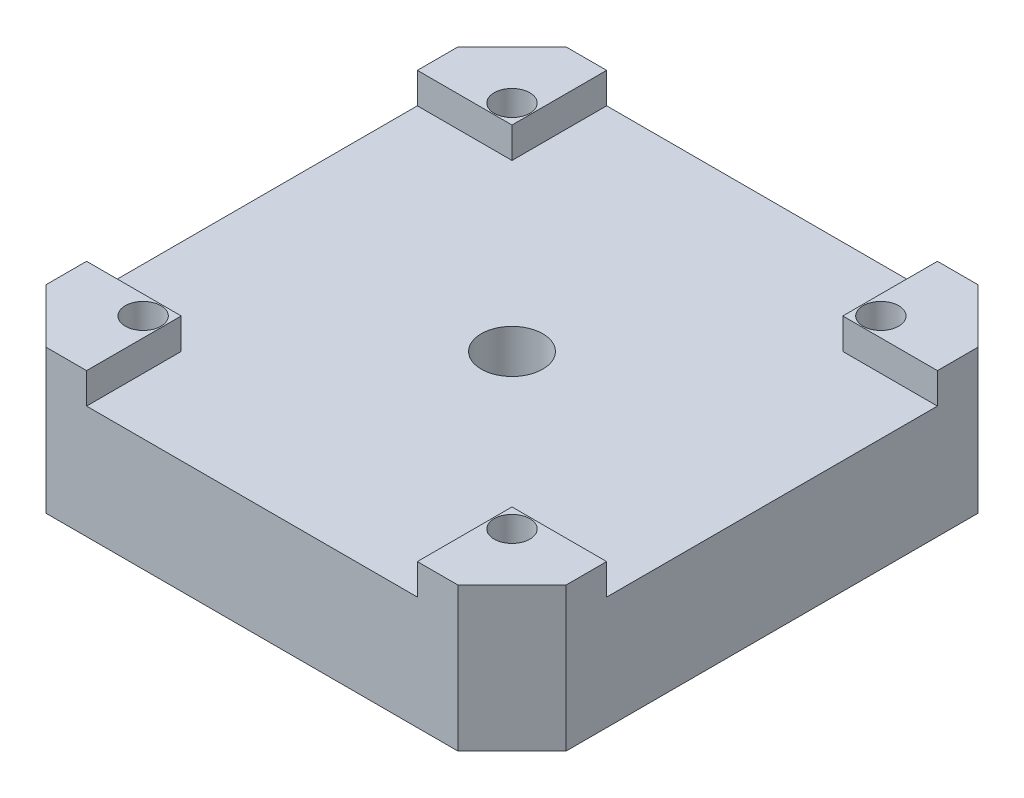
ISO-10303-21;
HEADER;
FILE_DESCRIPTION(('STEP AP214'),'2;1');
FILE_NAME('part.step','',(''),(''),'','','');
FILE_SCHEMA(('AUTOMOTIVE_DESIGN { 1 0 10303 214 1 1 1 1 }'));
ENDSEC;
DATA;
#1=APPLICATION_CONTEXT('core data for automotive mechanical design processes');
#2=APPLICATION_PROTOCOL_DEFINITION('international standard','automotive_design',2000,#1);
#3=PRODUCT_CONTEXT('',#1,'mechanical');
#4=PRODUCT('Part','Part','',(#3));
#5=PRODUCT_RELATED_PRODUCT_CATEGORY('part','',(#4));
#6=PRODUCT_DEFINITION_FORMATION('','',#4);
#7=PRODUCT_DEFINITION_CONTEXT('part definition',#1,'design');
#8=PRODUCT_DEFINITION('design','',#6,#7);
#9=PRODUCT_DEFINITION_SHAPE('','',#8);
#10=(LENGTH_UNIT() NAMED_UNIT(*) SI_UNIT(.MILLI.,.METRE.));
#11=(NAMED_UNIT(*) PLANE_ANGLE_UNIT() SI_UNIT($,.RADIAN.));
#12=(NAMED_UNIT(*) SI_UNIT($,.STERADIAN.) SOLID_ANGLE_UNIT());
#13=UNCERTAINTY_MEASURE_WITH_UNIT(LENGTH_MEASURE(1.E-05),#10,'distance_accuracy_value','');
#14=(GEOMETRIC_REPRESENTATION_CONTEXT(3) GLOBAL_UNCERTAINTY_ASSIGNED_CONTEXT((#13)) GLOBAL_UNIT_ASSIGNED_CONTEXT((#10,
#11,#12)) REPRESENTATION_CONTEXT('',''));
#15=CARTESIAN_POINT('',(0.,0.,0.));
#16=DIRECTION('',(0.,0.,1.));
#17=DIRECTION('',(1.,0.,0.));
#18=AXIS2_PLACEMENT_3D('',#15,#16,#17);
#19=CARTESIAN_POINT('',(0.,11.7,0.));
#20=DIRECTION('',(0.,-1.,0.));
#21=DIRECTION('',(0.,0.,-1.));
#22=AXIS2_PLACEMENT_3D('',#19,#20,#21);
#23=PLANE('',#22);
#24=CARTESIAN_POINT('',(15.,11.7,-15.));
#25=DIRECTION('',(0.,-1.,0.));
#26=DIRECTION('',(0.,0.,-1.));
#27=AXIS2_PLACEMENT_3D('',#24,#25,#26);
#28=CIRCLE('',#27,1.45);
#29=CARTESIAN_POINT('',(15.,11.7,-16.45));
#30=VERTEX_POINT('',#29);
#31=EDGE_CURVE('E364',#30,#30,#28,.T.);
#32=ORIENTED_EDGE('',*,*,#31,.T.);
#33=EDGE_LOOP('',(#32));
#34=FACE_BOUND('',#33,.T.);
#35=DIRECTION('',(-1.,0.,0.));
#36=VECTOR('',#35,1.);
#37=CARTESIAN_POINT('',(-16.750923471599,11.7,-21.15));
#38=LINE('',#37,#36);
#39=CARTESIAN_POINT('',(16.750923471599,11.7,-21.15));
#40=VERTEX_POINT('',#39);
#41=CARTESIAN_POINT('',(13.450923471599,11.7,-21.15));
#42=VERTEX_POINT('',#41);
#43=EDGE_CURVE('E193',#40,#42,#38,.T.);
#44=ORIENTED_EDGE('',*,*,#43,.T.);
#45=DIRECTION('',(0.,0.,1.));
#46=VECTOR('',#45,1.);
#47=CARTESIAN_POINT('',(13.450923471599,11.7,-21.15));
#48=LINE('',#47,#46);
#49=CARTESIAN_POINT('',(13.450923471599,11.7,-13.4509234715989));
#50=VERTEX_POINT('',#49);
#51=EDGE_CURVE('E301',#42,#50,#48,.T.);
#52=ORIENTED_EDGE('',*,*,#51,.T.);
#53=DIRECTION('',(1.,0.,0.));
#54=VECTOR('',#53,1.);
#55=CARTESIAN_POINT('',(-21.15,11.7,-13.4509234715989));
#56=LINE('',#55,#54);
#57=CARTESIAN_POINT('',(21.15,11.7,-13.4509234715989));
#58=VERTEX_POINT('',#57);
#59=EDGE_CURVE('E287',#50,#58,#56,.T.);
#60=ORIENTED_EDGE('',*,*,#59,.T.);
#61=DIRECTION('',(0.,0.,-1.));
#62=VECTOR('',#61,1.);
#63=CARTESIAN_POINT('',(21.15,11.7,16.7509234715989));
#64=LINE('',#63,#62);
#65=CARTESIAN_POINT('',(21.15,11.7,-16.7509234715989));
#66=VERTEX_POINT('',#65);
#67=EDGE_CURVE('E275',#58,#66,#64,.T.);
#68=ORIENTED_EDGE('',*,*,#67,.T.);
#69=DIRECTION('',(-0.707106781186542,0.,-0.707106781186553));
#70=VECTOR('',#69,1.);
#71=CARTESIAN_POINT('',(16.750923471599,11.7,-21.15));
#72=LINE('',#71,#70);
#73=EDGE_CURVE('E194',#66,#40,#72,.T.);
#74=ORIENTED_EDGE('',*,*,#73,.T.);
#75=EDGE_LOOP('',(#44,#52,#60,#68,#74));
#76=FACE_BOUND('',#75,.T.);
#77=ADVANCED_FACE('F34',(#34,#76),#23,.F.);
#78=CARTESIAN_POINT('',(15.,11.7,15.));
#79=DIRECTION('',(0.,-1.,0.));
#80=DIRECTION('',(0.,0.,-1.));
#81=AXIS2_PLACEMENT_3D('',#78,#79,#80);
#82=CIRCLE('',#81,1.45);
#83=CARTESIAN_POINT('',(15.,11.7,13.55));
#84=VERTEX_POINT('',#83);
#85=EDGE_CURVE('E376',#84,#84,#82,.T.);
#86=ORIENTED_EDGE('',*,*,#85,.T.);
#87=EDGE_LOOP('',(#86));
#88=FACE_BOUND('',#87,.T.);
#89=DIRECTION('',(1.,0.,0.));
#90=VECTOR('',#89,1.);
#91=CARTESIAN_POINT('',(-21.15,11.7,13.4509234715989));
#92=LINE('',#91,#90);
#93=CARTESIAN_POINT('',(13.450923471599,11.7,13.4509234715989));
#94=VERTEX_POINT('',#93);
#95=CARTESIAN_POINT('',(21.15,11.7,13.4509234715989));
#96=VERTEX_POINT('',#95);
#97=EDGE_CURVE('E265',#94,#96,#92,.T.);
#98=ORIENTED_EDGE('',*,*,#97,.F.);
#99=CARTESIAN_POINT('',(13.450923471599,11.7,21.15));
#100=VERTEX_POINT('',#99);
#101=EDGE_CURVE('E304',#94,#100,#48,.T.);
#102=ORIENTED_EDGE('',*,*,#101,.T.);
#103=DIRECTION('',(1.,0.,0.));
#104=VECTOR('',#103,1.);
#105=CARTESIAN_POINT('',(-16.750923471599,11.7,21.15));
#106=LINE('',#105,#104);
#107=CARTESIAN_POINT('',(16.750923471599,11.7,21.15));
#108=VERTEX_POINT('',#107);
#109=EDGE_CURVE('E270',#100,#108,#106,.T.);
#110=ORIENTED_EDGE('',*,*,#109,.T.);
#111=DIRECTION('',(0.707106781186546,0.,-0.707106781186549));
#112=VECTOR('',#111,1.);
#113=CARTESIAN_POINT('',(16.750923471599,11.7,21.15));
#114=LINE('',#113,#112);
#115=CARTESIAN_POINT('',(21.15,11.7,16.7509234715989));
#116=VERTEX_POINT('',#115);
#117=EDGE_CURVE('E274',#108,#116,#114,.T.);
#118=ORIENTED_EDGE('',*,*,#117,.T.);
#119=EDGE_CURVE('E198',#116,#96,#64,.T.);
#120=ORIENTED_EDGE('',*,*,#119,.T.);
#121=EDGE_LOOP('',(#98,#102,#110,#118,#120));
#122=FACE_BOUND('',#121,.T.);
#123=ADVANCED_FACE('F437',(#88,#122),#23,.F.);
#124=CARTESIAN_POINT('',(-21.15,9.2,-13.4509234715989));
#125=DIRECTION('',(0.,0.,-1.));
#126=DIRECTION('',(-1.,0.,0.));
#127=AXIS2_PLACEMENT_3D('',#124,#125,#126);
#128=PLANE('',#127);
#129=ORIENTED_EDGE('',*,*,#59,.F.);
#130=DIRECTION('',(0.,-1.,0.));
#131=VECTOR('',#130,1.);
#132=CARTESIAN_POINT('',(13.450923471599,9.20000000000002,-13.4509234715989));
#133=LINE('',#132,#131);
#134=CARTESIAN_POINT('',(13.450923471599,9.2,-13.4509234715989));
#135=VERTEX_POINT('',#134);
#136=EDGE_CURVE('E309',#50,#135,#133,.T.);
#137=ORIENTED_EDGE('',*,*,#136,.T.);
#138=DIRECTION('',(1.,0.,0.));
#139=VECTOR('',#138,1.);
#140=CARTESIAN_POINT('',(-21.15,9.2,-13.4509234715989));
#141=LINE('',#140,#139);
#142=CARTESIAN_POINT('',(21.15,9.2,-13.4509234715989));
#143=VERTEX_POINT('',#142);
#144=EDGE_CURVE('E257',#135,#143,#141,.T.);
#145=ORIENTED_EDGE('',*,*,#144,.T.);
#146=DIRECTION('',(0.,1.,0.));
#147=VECTOR('',#146,1.);
#148=CARTESIAN_POINT('',(21.15,9.2,-13.4509234715989));
#149=LINE('',#148,#147);
#150=EDGE_CURVE('E311',#143,#58,#149,.T.);
#151=ORIENTED_EDGE('',*,*,#150,.T.);
#152=EDGE_LOOP('',(#129,#137,#145,#151));
#153=FACE_BOUND('',#152,.T.);
#154=ADVANCED_FACE('F308',(#153),#128,.F.);
#155=CARTESIAN_POINT('',(-21.15,11.7,13.4509234715989));
#156=DIRECTION('',(0.,0.,1.));
#157=DIRECTION('',(1.,0.,0.));
#158=AXIS2_PLACEMENT_3D('',#155,#156,#157);
#159=PLANE('',#158);
#160=DIRECTION('',(1.,0.,0.));
#161=VECTOR('',#160,1.);
#162=CARTESIAN_POINT('',(-21.15,9.2,13.4509234715989));
#163=LINE('',#162,#161);
#164=CARTESIAN_POINT('',(13.450923471599,9.2,13.4509234715989));
#165=VERTEX_POINT('',#164);
#166=CARTESIAN_POINT('',(21.15,9.2,13.4509234715989));
#167=VERTEX_POINT('',#166);
#168=EDGE_CURVE('E258',#165,#167,#163,.T.);
#169=ORIENTED_EDGE('',*,*,#168,.F.);
#170=DIRECTION('',(0.,1.,0.));
#171=VECTOR('',#170,1.);
#172=CARTESIAN_POINT('',(13.450923471599,11.7,13.4509234715989));
#173=LINE('',#172,#171);
#174=EDGE_CURVE('E11',#165,#94,#173,.T.);
#175=ORIENTED_EDGE('',*,*,#174,.T.);
#176=ORIENTED_EDGE('',*,*,#97,.T.);
#177=DIRECTION('',(0.,-1.,0.));
#178=VECTOR('',#177,1.);
#179=CARTESIAN_POINT('',(21.15,11.7,13.4509234715989));
#180=LINE('',#179,#178);
#181=EDGE_CURVE('E319',#96,#167,#180,.T.);
#182=ORIENTED_EDGE('',*,*,#181,.T.);
#183=EDGE_LOOP('',(#169,#175,#176,#182));
#184=FACE_BOUND('',#183,.T.);
#185=ADVANCED_FACE('F447',(#184),#159,.F.);
#186=CARTESIAN_POINT('',(-15.,11.7,-15.));
#187=DIRECTION('',(0.,-1.,0.));
#188=DIRECTION('',(0.,0.,-1.));
#189=AXIS2_PLACEMENT_3D('',#186,#187,#188);
#190=CIRCLE('',#189,1.45);
#191=CARTESIAN_POINT('',(-15.,11.7,-16.45));
#192=VERTEX_POINT('',#191);
#193=EDGE_CURVE('E352',#192,#192,#190,.T.);
#194=ORIENTED_EDGE('',*,*,#193,.T.);
#195=EDGE_LOOP('',(#194));
#196=FACE_BOUND('',#195,.T.);
#197=CARTESIAN_POINT('',(-21.15,11.7,-13.4509234715989));
#198=VERTEX_POINT('',#197);
#199=CARTESIAN_POINT('',(-13.450923471599,11.7,-13.4509234715989));
#200=VERTEX_POINT('',#199);
#201=EDGE_CURVE('E186',#198,#200,#56,.T.);
#202=ORIENTED_EDGE('',*,*,#201,.T.);
#203=DIRECTION('',(0.,0.,1.));
#204=VECTOR('',#203,1.);
#205=CARTESIAN_POINT('',(-13.450923471599,11.7,-21.15));
#206=LINE('',#205,#204);
#207=CARTESIAN_POINT('',(-13.450923471599,11.7,-21.15));
#208=VERTEX_POINT('',#207);
#209=EDGE_CURVE('E49',#208,#200,#206,.T.);
#210=ORIENTED_EDGE('',*,*,#209,.F.);
#211=CARTESIAN_POINT('',(-16.750923471599,11.7,-21.15));
#212=VERTEX_POINT('',#211);
#213=EDGE_CURVE('E183',#208,#212,#38,.T.);
#214=ORIENTED_EDGE('',*,*,#213,.T.);
#215=DIRECTION('',(-0.707106781186546,0.,0.707106781186549));
#216=VECTOR('',#215,1.);
#217=CARTESIAN_POINT('',(-21.15,11.7,-16.7509234715989));
#218=LINE('',#217,#216);
#219=CARTESIAN_POINT('',(-21.15,11.7,-16.7509234715989));
#220=VERTEX_POINT('',#219);
#221=EDGE_CURVE('E197',#212,#220,#218,.T.);
#222=ORIENTED_EDGE('',*,*,#221,.T.);
#223=DIRECTION('',(0.,0.,1.));
#224=VECTOR('',#223,1.);
#225=CARTESIAN_POINT('',(-21.15,11.7,16.7509234715989));
#226=LINE('',#225,#224);
#227=EDGE_CURVE('E266',#220,#198,#226,.T.);
#228=ORIENTED_EDGE('',*,*,#227,.T.);
#229=EDGE_LOOP('',(#202,#210,#214,#222,#228));
#230=FACE_BOUND('',#229,.T.);
#231=ADVANCED_FACE('F182',(#196,#230),#23,.F.);
#232=CARTESIAN_POINT('',(-21.15,11.7,16.7509234715989));
#233=DIRECTION('',(1.,0.,0.));
#234=DIRECTION('',(0.,0.,-1.));
#235=AXIS2_PLACEMENT_3D('',#232,#233,#234);
#236=PLANE('',#235);
#237=DIRECTION('',(0.,0.,-1.));
#238=VECTOR('',#237,1.);
#239=CARTESIAN_POINT('',(-21.15,9.2,13.4509234715989));
#240=LINE('',#239,#238);
#241=CARTESIAN_POINT('',(-21.15,9.2,13.4509234715989));
#242=VERTEX_POINT('',#241);
#243=CARTESIAN_POINT('',(-21.15,9.2,-13.4509234715989));
#244=VERTEX_POINT('',#243);
#245=EDGE_CURVE('E255',#242,#244,#240,.T.);
#246=ORIENTED_EDGE('',*,*,#245,.T.);
#247=DIRECTION('',(0.,1.,0.));
#248=VECTOR('',#247,1.);
#249=CARTESIAN_POINT('',(-21.15,9.2,-13.4509234715989));
#250=LINE('',#249,#248);
#251=EDGE_CURVE('E322',#244,#198,#250,.T.);
#252=ORIENTED_EDGE('',*,*,#251,.T.);
#253=ORIENTED_EDGE('',*,*,#227,.F.);
#254=DIRECTION('',(0.,-1.,0.));
#255=VECTOR('',#254,1.);
#256=CARTESIAN_POINT('',(-21.15,11.7,-16.7509234715989));
#257=LINE('',#256,#255);
#258=CARTESIAN_POINT('',(-21.15,0.,-16.7509234715989));
#259=VERTEX_POINT('',#258);
#260=EDGE_CURVE('E203',#220,#259,#257,.T.);
#261=ORIENTED_EDGE('',*,*,#260,.T.);
#262=DIRECTION('',(0.,0.,1.));
#263=VECTOR('',#262,1.);
#264=CARTESIAN_POINT('',(-21.15,0.,16.7509234715989));
#265=LINE('',#264,#263);
#266=CARTESIAN_POINT('',(-21.15,0.,16.7509234715989));
#267=VERTEX_POINT('',#266);
#268=EDGE_CURVE('E204',#259,#267,#265,.T.);
#269=ORIENTED_EDGE('',*,*,#268,.T.);
#270=DIRECTION('',(0.,-1.,0.));
#271=VECTOR('',#270,1.);
#272=CARTESIAN_POINT('',(-21.15,11.7,16.7509234715989));
#273=LINE('',#272,#271);
#274=CARTESIAN_POINT('',(-21.15,11.7,16.7509234715989));
#275=VERTEX_POINT('',#274);
#276=EDGE_CURVE('E240',#275,#267,#273,.T.);
#277=ORIENTED_EDGE('',*,*,#276,.F.);
#278=CARTESIAN_POINT('',(-21.15,11.7,13.4509234715989));
#279=VERTEX_POINT('',#278);
#280=EDGE_CURVE('E221',#279,#275,#226,.T.);
#281=ORIENTED_EDGE('',*,*,#280,.F.);
#282=DIRECTION('',(0.,-1.,0.));
#283=VECTOR('',#282,1.);
#284=CARTESIAN_POINT('',(-21.15,11.7,13.4509234715989));
#285=LINE('',#284,#283);
#286=EDGE_CURVE('E315',#279,#242,#285,.T.);
#287=ORIENTED_EDGE('',*,*,#286,.T.);
#288=EDGE_LOOP('',(#246,#252,#253,#261,#269,#277,#281,#287));
#289=FACE_BOUND('',#288,.T.);
#290=ADVANCED_FACE('F36',(#289),#236,.F.);
#291=CARTESIAN_POINT('',(-21.15,11.7,16.7509234715989));
#292=DIRECTION('',(0.707106781186553,0.,-0.707106781186542));
#293=DIRECTION('',(-0.707106781186542,0.,-0.707106781186553));
#294=AXIS2_PLACEMENT_3D('',#291,#292,#293);
#295=PLANE('',#294);
#296=DIRECTION('',(0.707106781186542,0.,0.707106781186553));
#297=VECTOR('',#296,1.);
#298=CARTESIAN_POINT('',(-21.15,0.,16.7509234715989));
#299=LINE('',#298,#297);
#300=CARTESIAN_POINT('',(-16.750923471599,0.,21.15));
#301=VERTEX_POINT('',#300);
#302=EDGE_CURVE('E207',#267,#301,#299,.T.);
#303=ORIENTED_EDGE('',*,*,#302,.T.);
#304=DIRECTION('',(0.,-1.,0.));
#305=VECTOR('',#304,1.);
#306=CARTESIAN_POINT('',(-16.750923471599,11.7,21.15));
#307=LINE('',#306,#305);
#308=CARTESIAN_POINT('',(-16.750923471599,11.7,21.15));
#309=VERTEX_POINT('',#308);
#310=EDGE_CURVE('E237',#309,#301,#307,.T.);
#311=ORIENTED_EDGE('',*,*,#310,.F.);
#312=DIRECTION('',(0.707106781186542,0.,0.707106781186553));
#313=VECTOR('',#312,1.);
#314=CARTESIAN_POINT('',(-21.15,11.7,16.7509234715989));
#315=LINE('',#314,#313);
#316=EDGE_CURVE('E268',#275,#309,#315,.T.);
#317=ORIENTED_EDGE('',*,*,#316,.F.);
#318=ORIENTED_EDGE('',*,*,#276,.T.);
#319=EDGE_LOOP('',(#303,#311,#317,#318));
#320=FACE_BOUND('',#319,.T.);
#321=ADVANCED_FACE('F720',(#320),#295,.F.);
#322=CARTESIAN_POINT('',(-16.750923471599,11.7,21.15));
#323=DIRECTION('',(0.,0.,-1.));
#324=DIRECTION('',(-1.,0.,0.));
#325=AXIS2_PLACEMENT_3D('',#322,#323,#324);
#326=PLANE('',#325);
#327=ORIENTED_EDGE('',*,*,#109,.F.);
#328=DIRECTION('',(0.,1.,0.));
#329=VECTOR('',#328,1.);
#330=CARTESIAN_POINT('',(13.450923471599,9.2,21.15));
#331=LINE('',#330,#329);
#332=CARTESIAN_POINT('',(13.450923471599,9.2,21.15));
#333=VERTEX_POINT('',#332);
#334=EDGE_CURVE('E178',#333,#100,#331,.T.);
#335=ORIENTED_EDGE('',*,*,#334,.F.);
#336=DIRECTION('',(1.,0.,0.));
#337=VECTOR('',#336,1.);
#338=CARTESIAN_POINT('',(-13.450923471599,9.2,21.15));
#339=LINE('',#338,#337);
#340=CARTESIAN_POINT('',(-13.450923471599,9.2,21.15));
#341=VERTEX_POINT('',#340);
#342=EDGE_CURVE('E334',#341,#333,#339,.T.);
#343=ORIENTED_EDGE('',*,*,#342,.F.);
#344=DIRECTION('',(0.,-1.,0.));
#345=VECTOR('',#344,1.);
#346=CARTESIAN_POINT('',(-13.450923471599,11.7,21.15));
#347=LINE('',#346,#345);
#348=CARTESIAN_POINT('',(-13.450923471599,11.7,21.15));
#349=VERTEX_POINT('',#348);
#350=EDGE_CURVE('E336',#349,#341,#347,.T.);
#351=ORIENTED_EDGE('',*,*,#350,.F.);
#352=EDGE_CURVE('E271',#309,#349,#106,.T.);
#353=ORIENTED_EDGE('',*,*,#352,.F.);
#354=ORIENTED_EDGE('',*,*,#310,.T.);
#355=DIRECTION('',(1.,0.,0.));
#356=VECTOR('',#355,1.);
#357=CARTESIAN_POINT('',(-16.750923471599,0.,21.15));
#358=LINE('',#357,#356);
#359=CARTESIAN_POINT('',(16.750923471599,0.,21.15));
#360=VERTEX_POINT('',#359);
#361=EDGE_CURVE('E209',#301,#360,#358,.T.);
#362=ORIENTED_EDGE('',*,*,#361,.T.);
#363=DIRECTION('',(0.,-1.,0.));
#364=VECTOR('',#363,1.);
#365=CARTESIAN_POINT('',(16.750923471599,11.7,21.15));
#366=LINE('',#365,#364);
#367=EDGE_CURVE('E234',#108,#360,#366,.T.);
#368=ORIENTED_EDGE('',*,*,#367,.F.);
#369=EDGE_LOOP('',(#327,#335,#343,#351,#353,#354,#362,#368));
#370=FACE_BOUND('',#369,.T.);
#371=ADVANCED_FACE('F739',(#370),#326,.F.);
#372=CARTESIAN_POINT('',(16.750923471599,11.7,21.15));
#373=DIRECTION('',(-0.707106781186549,0.,-0.707106781186546));
#374=DIRECTION('',(-0.707106781186546,0.,0.707106781186549));
#375=AXIS2_PLACEMENT_3D('',#372,#373,#374);
#376=PLANE('',#375);
#377=DIRECTION('',(0.707106781186546,0.,-0.707106781186549));
#378=VECTOR('',#377,1.);
#379=CARTESIAN_POINT('',(16.750923471599,0.,21.15));
#380=LINE('',#379,#378);
#381=CARTESIAN_POINT('',(21.15,0.,16.7509234715989));
#382=VERTEX_POINT('',#381);
#383=EDGE_CURVE('E211',#360,#382,#380,.T.);
#384=ORIENTED_EDGE('',*,*,#383,.T.);
#385=DIRECTION('',(0.,-1.,0.));
#386=VECTOR('',#385,1.);
#387=CARTESIAN_POINT('',(21.15,11.7,16.7509234715989));
#388=LINE('',#387,#386);
#389=EDGE_CURVE('E231',#116,#382,#388,.T.);
#390=ORIENTED_EDGE('',*,*,#389,.F.);
#391=ORIENTED_EDGE('',*,*,#117,.F.);
#392=ORIENTED_EDGE('',*,*,#367,.T.);
#393=EDGE_LOOP('',(#384,#390,#391,#392));
#394=FACE_BOUND('',#393,.T.);
#395=ADVANCED_FACE('F709',(#394),#376,.F.);
#396=CARTESIAN_POINT('',(21.15,11.7,16.7509234715989));
#397=DIRECTION('',(-1.,0.,0.));
#398=DIRECTION('',(0.,0.,1.));
#399=AXIS2_PLACEMENT_3D('',#396,#397,#398);
#400=PLANE('',#399);
#401=ORIENTED_EDGE('',*,*,#67,.F.);
#402=ORIENTED_EDGE('',*,*,#150,.F.);
#403=DIRECTION('',(0.,0.,-1.));
#404=VECTOR('',#403,1.);
#405=CARTESIAN_POINT('',(21.15,9.2,13.4509234715989));
#406=LINE('',#405,#404);
#407=EDGE_CURVE('E316',#167,#143,#406,.T.);
#408=ORIENTED_EDGE('',*,*,#407,.F.);
#409=ORIENTED_EDGE('',*,*,#181,.F.);
#410=ORIENTED_EDGE('',*,*,#119,.F.);
#411=ORIENTED_EDGE('',*,*,#389,.T.);
#412=DIRECTION('',(0.,0.,-1.));
#413=VECTOR('',#412,1.);
#414=CARTESIAN_POINT('',(21.15,0.,16.7509234715989));
#415=LINE('',#414,#413);
#416=CARTESIAN_POINT('',(21.15,0.,-16.7509234715989));
#417=VERTEX_POINT('',#416);
#418=EDGE_CURVE('E213',#382,#417,#415,.T.);
#419=ORIENTED_EDGE('',*,*,#418,.T.);
#420=DIRECTION('',(0.,-1.,0.));
#421=VECTOR('',#420,1.);
#422=CARTESIAN_POINT('',(21.15,11.7,-16.7509234715989));
#423=LINE('',#422,#421);
#424=EDGE_CURVE('E228',#66,#417,#423,.T.);
#425=ORIENTED_EDGE('',*,*,#424,.F.);
#426=EDGE_LOOP('',(#401,#402,#408,#409,#410,#411,#419,#425));
#427=FACE_BOUND('',#426,.T.);
#428=ADVANCED_FACE('F291',(#427),#400,.F.);
#429=CARTESIAN_POINT('',(16.750923471599,11.7,-21.15));
#430=DIRECTION('',(-0.707106781186553,0.,0.707106781186542));
#431=DIRECTION('',(0.707106781186542,0.,0.707106781186553));
#432=AXIS2_PLACEMENT_3D('',#429,#430,#431);
#433=PLANE('',#432);
#434=DIRECTION('',(-0.707106781186542,0.,-0.707106781186553));
#435=VECTOR('',#434,1.);
#436=CARTESIAN_POINT('',(16.750923471599,0.,-21.15));
#437=LINE('',#436,#435);
#438=CARTESIAN_POINT('',(16.750923471599,0.,-21.15));
#439=VERTEX_POINT('',#438);
#440=EDGE_CURVE('E215',#417,#439,#437,.T.);
#441=ORIENTED_EDGE('',*,*,#440,.T.);
#442=DIRECTION('',(0.,-1.,0.));
#443=VECTOR('',#442,1.);
#444=CARTESIAN_POINT('',(16.750923471599,11.7,-21.15));
#445=LINE('',#444,#443);
#446=EDGE_CURVE('E225',#40,#439,#445,.T.);
#447=ORIENTED_EDGE('',*,*,#446,.F.);
#448=ORIENTED_EDGE('',*,*,#73,.F.);
#449=ORIENTED_EDGE('',*,*,#424,.T.);
#450=EDGE_LOOP('',(#441,#447,#448,#449));
#451=FACE_BOUND('',#450,.T.);
#452=ADVANCED_FACE('F295',(#451),#433,.F.);
#453=CARTESIAN_POINT('',(-16.750923471599,11.7,-21.15));
#454=DIRECTION('',(0.,0.,1.));
#455=DIRECTION('',(1.,0.,0.));
#456=AXIS2_PLACEMENT_3D('',#453,#454,#455);
#457=PLANE('',#456);
#458=DIRECTION('',(1.,0.,0.));
#459=VECTOR('',#458,1.);
#460=CARTESIAN_POINT('',(-13.450923471599,9.2,-21.15));
#461=LINE('',#460,#459);
#462=CARTESIAN_POINT('',(-13.450923471599,9.2,-21.15));
#463=VERTEX_POINT('',#462);
#464=CARTESIAN_POINT('',(13.450923471599,9.2,-21.15));
#465=VERTEX_POINT('',#464);
#466=EDGE_CURVE('E177',#463,#465,#461,.T.);
#467=ORIENTED_EDGE('',*,*,#466,.T.);
#468=DIRECTION('',(0.,1.,0.));
#469=VECTOR('',#468,1.);
#470=CARTESIAN_POINT('',(13.450923471599,9.2,-21.15));
#471=LINE('',#470,#469);
#472=EDGE_CURVE('E300',#465,#42,#471,.T.);
#473=ORIENTED_EDGE('',*,*,#472,.T.);
#474=ORIENTED_EDGE('',*,*,#43,.F.);
#475=ORIENTED_EDGE('',*,*,#446,.T.);
#476=DIRECTION('',(-1.,0.,0.));
#477=VECTOR('',#476,1.);
#478=CARTESIAN_POINT('',(-16.750923471599,0.,-21.15));
#479=LINE('',#478,#477);
#480=CARTESIAN_POINT('',(-16.750923471599,0.,-21.15));
#481=VERTEX_POINT('',#480);
#482=EDGE_CURVE('E217',#439,#481,#479,.T.);
#483=ORIENTED_EDGE('',*,*,#482,.T.);
#484=DIRECTION('',(0.,-1.,0.));
#485=VECTOR('',#484,1.);
#486=CARTESIAN_POINT('',(-16.750923471599,11.7,-21.15));
#487=LINE('',#486,#485);
#488=EDGE_CURVE('E191',#212,#481,#487,.T.);
#489=ORIENTED_EDGE('',*,*,#488,.F.);
#490=ORIENTED_EDGE('',*,*,#213,.F.);
#491=DIRECTION('',(0.,-1.,0.));
#492=VECTOR('',#491,1.);
#493=CARTESIAN_POINT('',(-13.450923471599,11.7,-21.15));
#494=LINE('',#493,#492);
#495=EDGE_CURVE('E169',#208,#463,#494,.T.);
#496=ORIENTED_EDGE('',*,*,#495,.T.);
#497=EDGE_LOOP('',(#467,#473,#474,#475,#483,#489,#490,#496));
#498=FACE_BOUND('',#497,.T.);
#499=ADVANCED_FACE('F189',(#498),#457,.F.);
#500=CARTESIAN_POINT('',(-21.15,11.7,-16.7509234715989));
#501=DIRECTION('',(0.707106781186549,0.,0.707106781186546));
#502=DIRECTION('',(0.707106781186546,0.,-0.707106781186549));
#503=AXIS2_PLACEMENT_3D('',#500,#501,#502);
#504=PLANE('',#503);
#505=DIRECTION('',(-0.707106781186546,0.,0.707106781186549));
#506=VECTOR('',#505,1.);
#507=CARTESIAN_POINT('',(-21.15,0.,-16.7509234715989));
#508=LINE('',#507,#506);
#509=EDGE_CURVE('E219',#481,#259,#508,.T.);
#510=ORIENTED_EDGE('',*,*,#509,.T.);
#511=ORIENTED_EDGE('',*,*,#260,.F.);
#512=ORIENTED_EDGE('',*,*,#221,.F.);
#513=ORIENTED_EDGE('',*,*,#488,.T.);
#514=EDGE_LOOP('',(#510,#511,#512,#513));
#515=FACE_BOUND('',#514,.T.);
#516=ADVANCED_FACE('F426',(#515),#504,.F.);
#517=CARTESIAN_POINT('',(-15.,11.7,15.));
#518=DIRECTION('',(0.,-1.,0.));
#519=DIRECTION('',(0.,0.,-1.));
#520=AXIS2_PLACEMENT_3D('',#517,#518,#519);
#521=CIRCLE('',#520,1.45);
#522=CARTESIAN_POINT('',(-15.,11.7,13.55));
#523=VERTEX_POINT('',#522);
#524=EDGE_CURVE('E388',#523,#523,#521,.T.);
#525=ORIENTED_EDGE('',*,*,#524,.T.);
#526=EDGE_LOOP('',(#525));
#527=FACE_BOUND('',#526,.T.);
#528=ORIENTED_EDGE('',*,*,#352,.T.);
#529=CARTESIAN_POINT('',(-13.450923471599,11.7,13.4509234715989));
#530=VERTEX_POINT('',#529);
#531=EDGE_CURVE('E187',#530,#349,#206,.T.);
#532=ORIENTED_EDGE('',*,*,#531,.F.);
#533=EDGE_CURVE('E249',#279,#530,#92,.T.);
#534=ORIENTED_EDGE('',*,*,#533,.F.);
#535=ORIENTED_EDGE('',*,*,#280,.T.);
#536=ORIENTED_EDGE('',*,*,#316,.T.);
#537=EDGE_LOOP('',(#528,#532,#534,#535,#536));
#538=FACE_BOUND('',#537,.T.);
#539=ADVANCED_FACE('F407',(#527,#538),#23,.F.);
#540=CARTESIAN_POINT('',(0.,0.,0.));
#541=DIRECTION('',(0.,-1.,0.));
#542=DIRECTION('',(0.,0.,-1.));
#543=AXIS2_PLACEMENT_3D('',#540,#541,#542);
#544=PLANE('',#543);
#545=CARTESIAN_POINT('',(-15.,0.,15.));
#546=DIRECTION('',(0.,-1.,0.));
#547=DIRECTION('',(0.,0.,-1.));
#548=AXIS2_PLACEMENT_3D('',#545,#546,#547);
#549=CIRCLE('',#548,3.);
#550=CARTESIAN_POINT('',(-15.,0.,12.));
#551=VERTEX_POINT('',#550);
#552=EDGE_CURVE('E397',#551,#551,#549,.T.);
#553=ORIENTED_EDGE('',*,*,#552,.F.);
#554=EDGE_LOOP('',(#553));
#555=FACE_BOUND('',#554,.T.);
#556=CARTESIAN_POINT('',(15.,0.,15.));
#557=DIRECTION('',(0.,-1.,0.));
#558=DIRECTION('',(0.,0.,-1.));
#559=AXIS2_PLACEMENT_3D('',#556,#557,#558);
#560=CIRCLE('',#559,3.);
#561=CARTESIAN_POINT('',(15.,0.,12.));
#562=VERTEX_POINT('',#561);
#563=EDGE_CURVE('E385',#562,#562,#560,.T.);
#564=ORIENTED_EDGE('',*,*,#563,.F.);
#565=EDGE_LOOP('',(#564));
#566=FACE_BOUND('',#565,.T.);
#567=CARTESIAN_POINT('',(15.,0.,-15.));
#568=DIRECTION('',(0.,-1.,0.));
#569=DIRECTION('',(0.,0.,-1.));
#570=AXIS2_PLACEMENT_3D('',#567,#568,#569);
#571=CIRCLE('',#570,3.);
#572=CARTESIAN_POINT('',(15.,0.,-18.));
#573=VERTEX_POINT('',#572);
#574=EDGE_CURVE('E373',#573,#573,#571,.T.);
#575=ORIENTED_EDGE('',*,*,#574,.F.);
#576=EDGE_LOOP('',(#575));
#577=FACE_BOUND('',#576,.T.);
#578=CARTESIAN_POINT('',(-15.,0.,-15.));
#579=DIRECTION('',(0.,-1.,0.));
#580=DIRECTION('',(0.,0.,-1.));
#581=AXIS2_PLACEMENT_3D('',#578,#579,#580);
#582=CIRCLE('',#581,3.);
#583=CARTESIAN_POINT('',(-15.,0.,-18.));
#584=VERTEX_POINT('',#583);
#585=EDGE_CURVE('E361',#584,#584,#582,.T.);
#586=ORIENTED_EDGE('',*,*,#585,.F.);
#587=EDGE_LOOP('',(#586));
#588=FACE_BOUND('',#587,.T.);
#589=CARTESIAN_POINT('',(0.,0.,0.));
#590=DIRECTION('',(0.,-1.,0.));
#591=DIRECTION('',(0.,0.,-1.));
#592=AXIS2_PLACEMENT_3D('',#589,#590,#591);
#593=CIRCLE('',#592,3.25);
#594=CARTESIAN_POINT('',(0.,0.,-3.25));
#595=VERTEX_POINT('',#594);
#596=EDGE_CURVE('E341',#595,#595,#593,.T.);
#597=ORIENTED_EDGE('',*,*,#596,.F.);
#598=EDGE_LOOP('',(#597));
#599=FACE_BOUND('',#598,.T.);
#600=ORIENTED_EDGE('',*,*,#268,.F.);
#601=ORIENTED_EDGE('',*,*,#509,.F.);
#602=ORIENTED_EDGE('',*,*,#482,.F.);
#603=ORIENTED_EDGE('',*,*,#440,.F.);
#604=ORIENTED_EDGE('',*,*,#418,.F.);
#605=ORIENTED_EDGE('',*,*,#383,.F.);
#606=ORIENTED_EDGE('',*,*,#361,.F.);
#607=ORIENTED_EDGE('',*,*,#302,.F.);
#608=EDGE_LOOP('',(#600,#601,#602,#603,#604,#605,#606,#607));
#609=FACE_BOUND('',#608,.T.);
#610=ADVANCED_FACE('F403',(#555,#566,#577,#588,#599,#609),#544,.T.);
#611=CARTESIAN_POINT('',(-13.450923471599,9.2,-13.4509234715989));
#612=VERTEX_POINT('',#611);
#613=EDGE_CURVE('E260',#244,#612,#141,.T.);
#614=ORIENTED_EDGE('',*,*,#613,.T.);
#615=DIRECTION('',(0.,1.,0.));
#616=VECTOR('',#615,1.);
#617=CARTESIAN_POINT('',(-13.450923471599,9.2,-13.4509234715989));
#618=LINE('',#617,#616);
#619=EDGE_CURVE('E303',#612,#200,#618,.T.);
#620=ORIENTED_EDGE('',*,*,#619,.T.);
#621=ORIENTED_EDGE('',*,*,#201,.F.);
#622=ORIENTED_EDGE('',*,*,#251,.F.);
#623=EDGE_LOOP('',(#614,#620,#621,#622));
#624=FACE_BOUND('',#623,.T.);
#625=ADVANCED_FACE('F406',(#624),#128,.F.);
#626=CARTESIAN_POINT('',(-21.15,9.2,13.4509234715989));
#627=DIRECTION('',(0.,-1.,0.));
#628=DIRECTION('',(0.,0.,-1.));
#629=AXIS2_PLACEMENT_3D('',#626,#627,#628);
#630=PLANE('',#629);
#631=CARTESIAN_POINT('',(0.,9.2,0.));
#632=DIRECTION('',(0.,-1.,0.));
#633=DIRECTION('',(0.,0.,-1.));
#634=AXIS2_PLACEMENT_3D('',#631,#632,#633);
#635=CIRCLE('',#634,2.5);
#636=CARTESIAN_POINT('',(0.,9.2,-2.5));
#637=VERTEX_POINT('',#636);
#638=EDGE_CURVE('E344',#637,#637,#635,.T.);
#639=ORIENTED_EDGE('',*,*,#638,.T.);
#640=EDGE_LOOP('',(#639));
#641=FACE_BOUND('',#640,.T.);
#642=CARTESIAN_POINT('',(-13.450923471599,9.2,13.4509234715989));
#643=VERTEX_POINT('',#642);
#644=EDGE_CURVE('E246',#242,#643,#163,.T.);
#645=ORIENTED_EDGE('',*,*,#644,.T.);
#646=DIRECTION('',(0.,0.,1.));
#647=VECTOR('',#646,1.);
#648=CARTESIAN_POINT('',(-13.450923471599,9.2,-21.15));
#649=LINE('',#648,#647);
#650=EDGE_CURVE('E57',#643,#341,#649,.T.);
#651=ORIENTED_EDGE('',*,*,#650,.T.);
#652=ORIENTED_EDGE('',*,*,#342,.T.);
#653=DIRECTION('',(0.,0.,1.));
#654=VECTOR('',#653,1.);
#655=CARTESIAN_POINT('',(13.450923471599,9.2,-21.15));
#656=LINE('',#655,#654);
#657=EDGE_CURVE('E330',#165,#333,#656,.T.);
#658=ORIENTED_EDGE('',*,*,#657,.F.);
#659=ORIENTED_EDGE('',*,*,#168,.T.);
#660=ORIENTED_EDGE('',*,*,#407,.T.);
#661=ORIENTED_EDGE('',*,*,#144,.F.);
#662=EDGE_CURVE('E331',#465,#135,#656,.T.);
#663=ORIENTED_EDGE('',*,*,#662,.F.);
#664=ORIENTED_EDGE('',*,*,#466,.F.);
#665=EDGE_CURVE('E172',#463,#612,#649,.T.);
#666=ORIENTED_EDGE('',*,*,#665,.T.);
#667=ORIENTED_EDGE('',*,*,#613,.F.);
#668=ORIENTED_EDGE('',*,*,#245,.F.);
#669=EDGE_LOOP('',(#645,#651,#652,#658,#659,#660,#661,#663,#664,#666,#667,#668));
#670=FACE_BOUND('',#669,.T.);
#671=ADVANCED_FACE('F252',(#641,#670),#630,.F.);
#672=ORIENTED_EDGE('',*,*,#533,.T.);
#673=DIRECTION('',(0.,-1.,0.));
#674=VECTOR('',#673,1.);
#675=CARTESIAN_POINT('',(-13.450923471599,11.7,13.4509234715989));
#676=LINE('',#675,#674);
#677=EDGE_CURVE('E42',#530,#643,#676,.T.);
#678=ORIENTED_EDGE('',*,*,#677,.T.);
#679=ORIENTED_EDGE('',*,*,#644,.F.);
#680=ORIENTED_EDGE('',*,*,#286,.F.);
#681=EDGE_LOOP('',(#672,#678,#679,#680));
#682=FACE_BOUND('',#681,.T.);
#683=ADVANCED_FACE('F245',(#682),#159,.F.);
#684=CARTESIAN_POINT('',(-13.450923471599,11.7,-21.15));
#685=DIRECTION('',(-1.,0.,0.));
#686=DIRECTION('',(0.,0.,1.));
#687=AXIS2_PLACEMENT_3D('',#684,#685,#686);
#688=PLANE('',#687);
#689=ORIENTED_EDGE('',*,*,#531,.T.);
#690=ORIENTED_EDGE('',*,*,#350,.T.);
#691=ORIENTED_EDGE('',*,*,#650,.F.);
#692=ORIENTED_EDGE('',*,*,#677,.F.);
#693=EDGE_LOOP('',(#689,#690,#691,#692));
#694=FACE_BOUND('',#693,.T.);
#695=ADVANCED_FACE('F446',(#694),#688,.F.);
#696=CARTESIAN_POINT('',(13.450923471599,9.2,-21.15));
#697=DIRECTION('',(1.,0.,0.));
#698=DIRECTION('',(0.,1.,0.));
#699=AXIS2_PLACEMENT_3D('',#696,#697,#698);
#700=PLANE('',#699);
#701=ORIENTED_EDGE('',*,*,#657,.T.);
#702=ORIENTED_EDGE('',*,*,#334,.T.);
#703=ORIENTED_EDGE('',*,*,#101,.F.);
#704=ORIENTED_EDGE('',*,*,#174,.F.);
#705=EDGE_LOOP('',(#701,#702,#703,#704));
#706=FACE_BOUND('',#705,.T.);
#707=ADVANCED_FACE('F460',(#706),#700,.F.);
#708=ORIENTED_EDGE('',*,*,#51,.F.);
#709=ORIENTED_EDGE('',*,*,#472,.F.);
#710=ORIENTED_EDGE('',*,*,#662,.T.);
#711=ORIENTED_EDGE('',*,*,#136,.F.);
#712=EDGE_LOOP('',(#708,#709,#710,#711));
#713=FACE_BOUND('',#712,.T.);
#714=ADVANCED_FACE('F457',(#713),#700,.F.);
#715=ORIENTED_EDGE('',*,*,#665,.F.);
#716=ORIENTED_EDGE('',*,*,#495,.F.);
#717=ORIENTED_EDGE('',*,*,#209,.T.);
#718=ORIENTED_EDGE('',*,*,#619,.F.);
#719=EDGE_LOOP('',(#715,#716,#717,#718));
#720=FACE_BOUND('',#719,.T.);
#721=ADVANCED_FACE('F170',(#720),#688,.F.);
#722=CARTESIAN_POINT('',(0.,3.,0.));
#723=DIRECTION('',(0.,-1.,0.));
#724=DIRECTION('',(0.,0.,-1.));
#725=AXIS2_PLACEMENT_3D('',#722,#723,#724);
#726=CYLINDRICAL_SURFACE('',#725,3.25);
#727=CARTESIAN_POINT('',(0.,3.,0.));
#728=DIRECTION('',(0.,-1.,0.));
#729=DIRECTION('',(0.,0.,-1.));
#730=AXIS2_PLACEMENT_3D('',#727,#728,#729);
#731=CIRCLE('',#730,3.25);
#732=CARTESIAN_POINT('',(0.,3.,-3.25));
#733=VERTEX_POINT('',#732);
#734=EDGE_CURVE('E338',#733,#733,#731,.T.);
#735=ORIENTED_EDGE('',*,*,#734,.F.);
#736=EDGE_LOOP('',(#735));
#737=FACE_BOUND('',#736,.T.);
#738=ORIENTED_EDGE('',*,*,#596,.T.);
#739=EDGE_LOOP('',(#738));
#740=FACE_BOUND('',#739,.T.);
#741=ADVANCED_FACE('F456',(#737,#740),#726,.F.);
#742=CARTESIAN_POINT('',(0.,3.,0.));
#743=DIRECTION('',(0.,-1.,0.));
#744=DIRECTION('',(0.,0.,-1.));
#745=AXIS2_PLACEMENT_3D('',#742,#743,#744);
#746=PLANE('',#745);
#747=CARTESIAN_POINT('',(0.,3.,0.));
#748=DIRECTION('',(0.,-1.,0.));
#749=DIRECTION('',(0.,0.,-1.));
#750=AXIS2_PLACEMENT_3D('',#747,#748,#749);
#751=CIRCLE('',#750,2.5);
#752=CARTESIAN_POINT('',(0.,3.,-2.5));
#753=VERTEX_POINT('',#752);
#754=EDGE_CURVE('E349',#753,#753,#751,.T.);
#755=ORIENTED_EDGE('',*,*,#754,.F.);
#756=EDGE_LOOP('',(#755));
#757=FACE_BOUND('',#756,.T.);
#758=ORIENTED_EDGE('',*,*,#734,.T.);
#759=EDGE_LOOP('',(#758));
#760=FACE_BOUND('',#759,.T.);
#761=ADVANCED_FACE('F463',(#757,#760),#746,.T.);
#762=CARTESIAN_POINT('',(0.,11.7,0.));
#763=DIRECTION('',(0.,-1.,0.));
#764=DIRECTION('',(0.,0.,-1.));
#765=AXIS2_PLACEMENT_3D('',#762,#763,#764);
#766=CYLINDRICAL_SURFACE('',#765,2.5);
#767=ORIENTED_EDGE('',*,*,#754,.T.);
#768=EDGE_LOOP('',(#767));
#769=FACE_BOUND('',#768,.T.);
#770=ORIENTED_EDGE('',*,*,#638,.F.);
#771=EDGE_LOOP('',(#770));
#772=FACE_BOUND('',#771,.T.);
#773=ADVANCED_FACE('F467',(#769,#772),#766,.F.);
#774=CARTESIAN_POINT('',(-15.,0.,-15.));
#775=DIRECTION('',(0.,-1.,0.));
#776=DIRECTION('',(0.,0.,-1.));
#777=AXIS2_PLACEMENT_3D('',#774,#775,#776);
#778=CYLINDRICAL_SURFACE('',#777,1.45);
#779=ORIENTED_EDGE('',*,*,#193,.F.);
#780=EDGE_LOOP('',(#779));
#781=FACE_BOUND('',#780,.T.);
#782=CARTESIAN_POINT('',(-15.,2.1,-15.));
#783=DIRECTION('',(0.,-1.,0.));
#784=DIRECTION('',(0.,0.,-1.));
#785=AXIS2_PLACEMENT_3D('',#782,#783,#784);
#786=CIRCLE('',#785,1.45);
#787=CARTESIAN_POINT('',(-15.,2.1,-16.45));
#788=VERTEX_POINT('',#787);
#789=EDGE_CURVE('E355',#788,#788,#786,.T.);
#790=ORIENTED_EDGE('',*,*,#789,.T.);
#791=EDGE_LOOP('',(#790));
#792=FACE_BOUND('',#791,.T.);
#793=ADVANCED_FACE('F471',(#781,#792),#778,.F.);
#794=CARTESIAN_POINT('',(-13.55,2.1,-15.));
#795=DIRECTION('',(0.,1.,0.));
#796=DIRECTION('',(0.,0.,1.));
#797=AXIS2_PLACEMENT_3D('',#794,#795,#796);
#798=PLANE('',#797);
#799=ORIENTED_EDGE('',*,*,#789,.F.);
#800=EDGE_LOOP('',(#799));
#801=FACE_BOUND('',#800,.T.);
#802=CARTESIAN_POINT('',(-15.,2.1,-15.));
#803=DIRECTION('',(0.,-1.,0.));
#804=DIRECTION('',(0.,0.,-1.));
#805=AXIS2_PLACEMENT_3D('',#802,#803,#804);
#806=CIRCLE('',#805,3.);
#807=CARTESIAN_POINT('',(-15.,2.1,-18.));
#808=VERTEX_POINT('',#807);
#809=EDGE_CURVE('E358',#808,#808,#806,.T.);
#810=ORIENTED_EDGE('',*,*,#809,.T.);
#811=EDGE_LOOP('',(#810));
#812=FACE_BOUND('',#811,.T.);
#813=ADVANCED_FACE('F475',(#801,#812),#798,.F.);
#814=CARTESIAN_POINT('',(-15.,0.,-15.));
#815=DIRECTION('',(0.,-1.,0.));
#816=DIRECTION('',(0.,0.,-1.));
#817=AXIS2_PLACEMENT_3D('',#814,#815,#816);
#818=CYLINDRICAL_SURFACE('',#817,3.);
#819=ORIENTED_EDGE('',*,*,#809,.F.);
#820=EDGE_LOOP('',(#819));
#821=FACE_BOUND('',#820,.T.);
#822=ORIENTED_EDGE('',*,*,#585,.T.);
#823=EDGE_LOOP('',(#822));
#824=FACE_BOUND('',#823,.T.);
#825=ADVANCED_FACE('F479',(#821,#824),#818,.F.);
#826=CARTESIAN_POINT('',(15.,0.,-15.));
#827=DIRECTION('',(0.,-1.,0.));
#828=DIRECTION('',(0.,0.,-1.));
#829=AXIS2_PLACEMENT_3D('',#826,#827,#828);
#830=CYLINDRICAL_SURFACE('',#829,1.45);
#831=ORIENTED_EDGE('',*,*,#31,.F.);
#832=EDGE_LOOP('',(#831));
#833=FACE_BOUND('',#832,.T.);
#834=CARTESIAN_POINT('',(15.,2.1,-15.));
#835=DIRECTION('',(0.,-1.,0.));
#836=DIRECTION('',(0.,0.,-1.));
#837=AXIS2_PLACEMENT_3D('',#834,#835,#836);
#838=CIRCLE('',#837,1.45);
#839=CARTESIAN_POINT('',(15.,2.1,-16.45));
#840=VERTEX_POINT('',#839);
#841=EDGE_CURVE('E367',#840,#840,#838,.T.);
#842=ORIENTED_EDGE('',*,*,#841,.T.);
#843=EDGE_LOOP('',(#842));
#844=FACE_BOUND('',#843,.T.);
#845=ADVANCED_FACE('F483',(#833,#844),#830,.F.);
#846=CARTESIAN_POINT('',(16.45,2.1,-15.));
#847=DIRECTION('',(0.,1.,0.));
#848=DIRECTION('',(0.,0.,1.));
#849=AXIS2_PLACEMENT_3D('',#846,#847,#848);
#850=PLANE('',#849);
#851=ORIENTED_EDGE('',*,*,#841,.F.);
#852=EDGE_LOOP('',(#851));
#853=FACE_BOUND('',#852,.T.);
#854=CARTESIAN_POINT('',(15.,2.1,-15.));
#855=DIRECTION('',(0.,-1.,0.));
#856=DIRECTION('',(0.,0.,-1.));
#857=AXIS2_PLACEMENT_3D('',#854,#855,#856);
#858=CIRCLE('',#857,3.);
#859=CARTESIAN_POINT('',(15.,2.1,-18.));
#860=VERTEX_POINT('',#859);
#861=EDGE_CURVE('E370',#860,#860,#858,.T.);
#862=ORIENTED_EDGE('',*,*,#861,.T.);
#863=EDGE_LOOP('',(#862));
#864=FACE_BOUND('',#863,.T.);
#865=ADVANCED_FACE('F487',(#853,#864),#850,.F.);
#866=CARTESIAN_POINT('',(15.,0.,-15.));
#867=DIRECTION('',(0.,-1.,0.));
#868=DIRECTION('',(0.,0.,-1.));
#869=AXIS2_PLACEMENT_3D('',#866,#867,#868);
#870=CYLINDRICAL_SURFACE('',#869,3.);
#871=ORIENTED_EDGE('',*,*,#861,.F.);
#872=EDGE_LOOP('',(#871));
#873=FACE_BOUND('',#872,.T.);
#874=ORIENTED_EDGE('',*,*,#574,.T.);
#875=EDGE_LOOP('',(#874));
#876=FACE_BOUND('',#875,.T.);
#877=ADVANCED_FACE('F491',(#873,#876),#870,.F.);
#878=CARTESIAN_POINT('',(15.,0.,15.));
#879=DIRECTION('',(0.,-1.,0.));
#880=DIRECTION('',(0.,0.,-1.));
#881=AXIS2_PLACEMENT_3D('',#878,#879,#880);
#882=CYLINDRICAL_SURFACE('',#881,1.45);
#883=ORIENTED_EDGE('',*,*,#85,.F.);
#884=EDGE_LOOP('',(#883));
#885=FACE_BOUND('',#884,.T.);
#886=CARTESIAN_POINT('',(15.,2.1,15.));
#887=DIRECTION('',(0.,-1.,0.));
#888=DIRECTION('',(0.,0.,-1.));
#889=AXIS2_PLACEMENT_3D('',#886,#887,#888);
#890=CIRCLE('',#889,1.45);
#891=CARTESIAN_POINT('',(15.,2.1,13.55));
#892=VERTEX_POINT('',#891);
#893=EDGE_CURVE('E379',#892,#892,#890,.T.);
#894=ORIENTED_EDGE('',*,*,#893,.T.);
#895=EDGE_LOOP('',(#894));
#896=FACE_BOUND('',#895,.T.);
#897=ADVANCED_FACE('F495',(#885,#896),#882,.F.);
#898=CARTESIAN_POINT('',(16.45,2.1,15.));
#899=DIRECTION('',(0.,1.,0.));
#900=DIRECTION('',(0.,0.,1.));
#901=AXIS2_PLACEMENT_3D('',#898,#899,#900);
#902=PLANE('',#901);
#903=ORIENTED_EDGE('',*,*,#893,.F.);
#904=EDGE_LOOP('',(#903));
#905=FACE_BOUND('',#904,.T.);
#906=CARTESIAN_POINT('',(15.,2.1,15.));
#907=DIRECTION('',(0.,-1.,0.));
#908=DIRECTION('',(0.,0.,-1.));
#909=AXIS2_PLACEMENT_3D('',#906,#907,#908);
#910=CIRCLE('',#909,3.);
#911=CARTESIAN_POINT('',(15.,2.1,12.));
#912=VERTEX_POINT('',#911);
#913=EDGE_CURVE('E382',#912,#912,#910,.T.);
#914=ORIENTED_EDGE('',*,*,#913,.T.);
#915=EDGE_LOOP('',(#914));
#916=FACE_BOUND('',#915,.T.);
#917=ADVANCED_FACE('F499',(#905,#916),#902,.F.);
#918=CARTESIAN_POINT('',(15.,0.,15.));
#919=DIRECTION('',(0.,-1.,0.));
#920=DIRECTION('',(0.,0.,-1.));
#921=AXIS2_PLACEMENT_3D('',#918,#919,#920);
#922=CYLINDRICAL_SURFACE('',#921,3.);
#923=ORIENTED_EDGE('',*,*,#913,.F.);
#924=EDGE_LOOP('',(#923));
#925=FACE_BOUND('',#924,.T.);
#926=ORIENTED_EDGE('',*,*,#563,.T.);
#927=EDGE_LOOP('',(#926));
#928=FACE_BOUND('',#927,.T.);
#929=ADVANCED_FACE('F503',(#925,#928),#922,.F.);
#930=CARTESIAN_POINT('',(-15.,0.,15.));
#931=DIRECTION('',(0.,-1.,0.));
#932=DIRECTION('',(0.,0.,-1.));
#933=AXIS2_PLACEMENT_3D('',#930,#931,#932);
#934=CYLINDRICAL_SURFACE('',#933,1.45);
#935=ORIENTED_EDGE('',*,*,#524,.F.);
#936=EDGE_LOOP('',(#935));
#937=FACE_BOUND('',#936,.T.);
#938=CARTESIAN_POINT('',(-15.,2.1,15.));
#939=DIRECTION('',(0.,-1.,0.));
#940=DIRECTION('',(0.,0.,-1.));
#941=AXIS2_PLACEMENT_3D('',#938,#939,#940);
#942=CIRCLE('',#941,1.45);
#943=CARTESIAN_POINT('',(-15.,2.1,13.55));
#944=VERTEX_POINT('',#943);
#945=EDGE_CURVE('E391',#944,#944,#942,.T.);
#946=ORIENTED_EDGE('',*,*,#945,.T.);
#947=EDGE_LOOP('',(#946));
#948=FACE_BOUND('',#947,.T.);
#949=ADVANCED_FACE('F507',(#937,#948),#934,.F.);
#950=CARTESIAN_POINT('',(-13.55,2.1,15.));
#951=DIRECTION('',(0.,1.,0.));
#952=DIRECTION('',(0.,0.,1.));
#953=AXIS2_PLACEMENT_3D('',#950,#951,#952);
#954=PLANE('',#953);
#955=ORIENTED_EDGE('',*,*,#945,.F.);
#956=EDGE_LOOP('',(#955));
#957=FACE_BOUND('',#956,.T.);
#958=CARTESIAN_POINT('',(-15.,2.1,15.));
#959=DIRECTION('',(0.,-1.,0.));
#960=DIRECTION('',(0.,0.,-1.));
#961=AXIS2_PLACEMENT_3D('',#958,#959,#960);
#962=CIRCLE('',#961,3.);
#963=CARTESIAN_POINT('',(-15.,2.1,12.));
#964=VERTEX_POINT('',#963);
#965=EDGE_CURVE('E394',#964,#964,#962,.T.);
#966=ORIENTED_EDGE('',*,*,#965,.T.);
#967=EDGE_LOOP('',(#966));
#968=FACE_BOUND('',#967,.T.);
#969=ADVANCED_FACE('F511',(#957,#968),#954,.F.);
#970=CARTESIAN_POINT('',(-15.,0.,15.));
#971=DIRECTION('',(0.,-1.,0.));
#972=DIRECTION('',(0.,0.,-1.));
#973=AXIS2_PLACEMENT_3D('',#970,#971,#972);
#974=CYLINDRICAL_SURFACE('',#973,3.);
#975=ORIENTED_EDGE('',*,*,#965,.F.);
#976=EDGE_LOOP('',(#975));
#977=FACE_BOUND('',#976,.T.);
#978=ORIENTED_EDGE('',*,*,#552,.T.);
#979=EDGE_LOOP('',(#978));
#980=FACE_BOUND('',#979,.T.);
#981=ADVANCED_FACE('F401',(#977,#980),#974,.F.);
#982=CLOSED_SHELL('',(#77,#123,#154,#185,#231,#290,#321,#371,#395,#428,#452,#499,#516,#539,#610,
#625,#671,#683,#695,#707,#714,#721,#741,#761,#773,#793,#813,#825,#845,#865,#877,#897,#917,#929,
#949,#969,#981));
#983=MANIFOLD_SOLID_BREP('B2',#982);
#984=ADVANCED_BREP_SHAPE_REPRESENTATION('',(#18,#983),#14);
#985=SHAPE_DEFINITION_REPRESENTATION(#9,#984);
ENDSEC;
END-ISO-10303-21;
